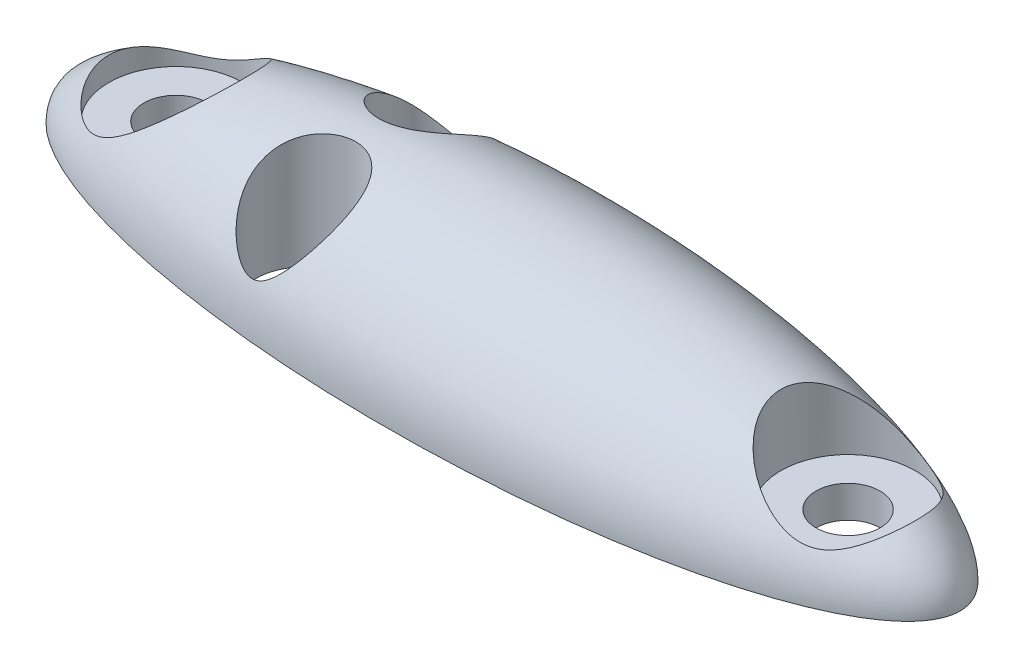
ISO-10303-21;
HEADER;
FILE_DESCRIPTION(('STEP AP214'),'2;1');
FILE_NAME('part.step','',(''),(''),'','','');
FILE_SCHEMA(('AUTOMOTIVE_DESIGN { 1 0 10303 214 1 1 1 1 }'));
ENDSEC;
DATA;
#1=APPLICATION_CONTEXT('core data for automotive mechanical design processes');
#2=APPLICATION_PROTOCOL_DEFINITION('international standard','automotive_design',2000,#1);
#3=PRODUCT_CONTEXT('',#1,'mechanical');
#4=PRODUCT('Part','Part','',(#3));
#5=PRODUCT_RELATED_PRODUCT_CATEGORY('part','',(#4));
#6=PRODUCT_DEFINITION_FORMATION('','',#4);
#7=PRODUCT_DEFINITION_CONTEXT('part definition',#1,'design');
#8=PRODUCT_DEFINITION('design','',#6,#7);
#9=PRODUCT_DEFINITION_SHAPE('','',#8);
#10=(LENGTH_UNIT() NAMED_UNIT(*) SI_UNIT(.MILLI.,.METRE.));
#11=(NAMED_UNIT(*) PLANE_ANGLE_UNIT() SI_UNIT($,.RADIAN.));
#12=(NAMED_UNIT(*) SI_UNIT($,.STERADIAN.) SOLID_ANGLE_UNIT());
#13=UNCERTAINTY_MEASURE_WITH_UNIT(LENGTH_MEASURE(1.E-05),#10,'distance_accuracy_value','');
#14=(GEOMETRIC_REPRESENTATION_CONTEXT(3) GLOBAL_UNCERTAINTY_ASSIGNED_CONTEXT((#13)) GLOBAL_UNIT_ASSIGNED_CONTEXT((#10,
#11,#12)) REPRESENTATION_CONTEXT('',''));
#15=CARTESIAN_POINT('',(0.,0.,0.));
#16=DIRECTION('',(0.,0.,1.));
#17=DIRECTION('',(1.,0.,0.));
#18=AXIS2_PLACEMENT_3D('',#15,#16,#17);
#19=CARTESIAN_POINT('',(0.,0.,0.));
#20=DIRECTION('',(0.,0.,1.));
#21=DIRECTION('',(1.,0.,0.));
#22=AXIS2_PLACEMENT_3D('',#19,#20,#21);
#23=ELLIPSE('',#22,14.,4.);
#24=TRIMMED_CURVE('',#23,(PARAMETER_VALUE(0.)),(PARAMETER_VALUE(3.14159265358979)),.T.,.PARAMETER.);
#25=CARTESIAN_POINT('',(-14.,0.,0.));
#26=DIRECTION('',(-1.,0.,0.));
#27=AXIS1_PLACEMENT('',#25,#26);
#28=SURFACE_OF_REVOLUTION('',#24,#27);
#29=CARTESIAN_POINT('',(-4.5,3.75458902884326,0.5));
#30=CARTESIAN_POINT('',(-4.41807485011896,3.76260614836175,0.50000363597045));
#31=CARTESIAN_POINT('',(-4.33595651778989,3.76951400484667,0.506736475512962));
#32=CARTESIAN_POINT('',(-4.17365789382002,3.78074165562019,0.533614555267595));
#33=CARTESIAN_POINT('',(-4.09348102663001,3.7850571571163,0.553781926500558));
#34=CARTESIAN_POINT('',(-3.9373667586053,3.7904003909163,0.60707313511103));
#35=CARTESIAN_POINT('',(-3.86143160721271,3.79142639471564,0.6402037739318));
#36=CARTESIAN_POINT('',(-3.71611708024833,3.78925528773884,0.718464693128925));
#37=CARTESIAN_POINT('',(-3.64673435057063,3.78606035030485,0.763588788578808));
#38=CARTESIAN_POINT('',(-3.5180087255229,3.77455230069718,0.863262391392315));
#39=CARTESIAN_POINT('',(-3.45847906139137,3.7663529388733,0.917583558350491));
#40=CARTESIAN_POINT('',(-3.34936442893969,3.74406836959943,1.03438083677035));
#41=CARTESIAN_POINT('',(-3.29977701911518,3.72998460979837,1.09685493989143));
#42=CARTESIAN_POINT('',(-3.213093005149,3.69588919890446,1.22559027741434));
#43=CARTESIAN_POINT('',(-3.17566229520513,3.67607092316599,1.29167847719049));
#44=CARTESIAN_POINT('',(-3.11177630355559,3.63023962510067,1.42691189099378));
#45=CARTESIAN_POINT('',(-3.08532102870517,3.60422659890459,1.49605710693031));
#46=CARTESIAN_POINT('',(-3.04276841530985,3.54562137017598,1.63668714066986));
#47=CARTESIAN_POINT('',(-3.02691778236253,3.51289418396723,1.70818957739984));
#48=CARTESIAN_POINT('',(-3.00580000899827,3.44186641187751,1.84995489692191));
#49=CARTESIAN_POINT('',(-3.00053894850754,3.40356263776331,1.92021704467924));
#50=CARTESIAN_POINT('',(-2.99935689992467,3.30719042563368,2.08327677369147));
#51=CARTESIAN_POINT('',(-3.00757555192905,3.24702949593765,2.17487422035254));
#52=CARTESIAN_POINT('',(-3.03877345363219,3.11985797810039,2.35043130917025));
#53=CARTESIAN_POINT('',(-3.06177607581734,3.05283668547919,2.43437861659217));
#54=CARTESIAN_POINT('',(-3.12908249893021,2.89161370596845,2.61892876740179));
#55=CARTESIAN_POINT('',(-3.17784032613489,2.7955609691125,2.71630372345697));
#56=CARTESIAN_POINT('',(-3.26317771342101,2.64779471493416,2.85034619804501));
#57=CARTESIAN_POINT('',(-3.29372364007854,2.59783058144781,2.89309038450693));
#58=CARTESIAN_POINT('',(-3.35854969867923,2.49707049018814,2.97457648241475));
#59=CARTESIAN_POINT('',(-3.39282851727974,2.44627483028071,3.01331979220137));
#60=CARTESIAN_POINT('',(-3.46575099768298,2.34303063644698,3.08770852455896));
#61=CARTESIAN_POINT('',(-3.50448096498131,2.29057207938731,3.12325489979644));
#62=CARTESIAN_POINT('',(-3.58549818344573,2.18575275922804,3.19014527083095));
#63=CARTESIAN_POINT('',(-3.62778423360408,2.13339196916781,3.22149067623285));
#64=CARTESIAN_POINT('',(-3.71588894260722,2.02959732931687,3.27982527293116));
#65=CARTESIAN_POINT('',(-3.76169430286799,1.97816081638799,3.30682977605818));
#66=CARTESIAN_POINT('',(-3.85734448052726,1.87699550229663,3.35642877495267));
#67=CARTESIAN_POINT('',(-3.90718520523312,1.82726504197265,3.37902766155747));
#68=CARTESIAN_POINT('',(-3.99618142916944,1.74542119024877,3.41340443431612));
#69=CARTESIAN_POINT('',(-4.03409516822564,1.71247411394185,3.42640012077026));
#70=CARTESIAN_POINT('',(-4.11287772249554,1.64908656059218,3.44976829535502));
#71=CARTESIAN_POINT('',(-4.15375111048626,1.61865012475627,3.46013660788907));
#72=CARTESIAN_POINT('',(-4.23946601041184,1.56152647205924,3.47785844625689));
#73=CARTESIAN_POINT('',(-4.28434955223465,1.5348890767369,3.48517397529937));
#74=CARTESIAN_POINT('',(-4.37800232272343,1.48853333917191,3.49576445431835));
#75=CARTESIAN_POINT('',(-4.42675475479499,1.46878690213824,3.49905595133379));
#76=CARTESIAN_POINT('',(-4.51010798901148,1.44477665734306,3.50032952233725));
#77=CARTESIAN_POINT('',(-4.54380978678468,1.43752373568976,3.4997482206439));
#78=CARTESIAN_POINT('',(-4.61180515951629,1.42842206532705,3.49621306070246));
#79=CARTESIAN_POINT('',(-4.6460979410206,1.42656656418169,3.49326217282802));
#80=CARTESIAN_POINT('',(-4.71423600859163,1.42847736034345,3.48501911761435));
#81=CARTESIAN_POINT('',(-4.74808124478457,1.4322442789662,3.47972669156468));
#82=CARTESIAN_POINT('',(-4.81442741130379,1.44481334973346,3.46706546679543));
#83=CARTESIAN_POINT('',(-4.84692627457216,1.45362295742576,3.45969360185707));
#84=CARTESIAN_POINT('',(-4.92601632692372,1.48071701343193,3.43907038116576));
#85=CARTESIAN_POINT('',(-4.97143606136329,1.50153958780102,3.42472989713746));
#86=CARTESIAN_POINT('',(-5.0580321712192,1.54898094407094,3.39310530977962));
#87=CARTESIAN_POINT('',(-5.09919344175167,1.57561938160205,3.37581126867891));
#88=CARTESIAN_POINT('',(-5.17693664663546,1.6318404067838,3.33923809105167));
#89=CARTESIAN_POINT('',(-5.21359709886264,1.66134869878057,3.32000874931687));
#90=CARTESIAN_POINT('',(-5.283894874729,1.72252486701728,3.27951385884961));
#91=CARTESIAN_POINT('',(-5.31752933297703,1.75419474124298,3.2582464187292));
#92=CARTESIAN_POINT('',(-5.38220820647823,1.81893673124208,3.21377548625682));
#93=CARTESIAN_POINT('',(-5.41324723362669,1.85201155918602,3.19056815698193));
#94=CARTESIAN_POINT('',(-5.47292660653057,1.91898204000486,3.14231594775773));
#95=CARTESIAN_POINT('',(-5.50156629496794,1.95287791455467,3.11727056776225));
#96=CARTESIAN_POINT('',(-5.57046359348816,2.03829791805734,3.05230475598018));
#97=CARTESIAN_POINT('',(-5.60930840754901,2.09010302534626,3.01124519233934));
#98=CARTESIAN_POINT('',(-5.68211136788364,2.19382860978281,2.92509037022632));
#99=CARTESIAN_POINT('',(-5.71606718976329,2.24574912996813,2.87999320855825));
#100=CARTESIAN_POINT('',(-5.77889659163847,2.34895876461261,2.785886661709));
#101=CARTESIAN_POINT('',(-5.80777799666982,2.40024873576438,2.73688347254694));
#102=CARTESIAN_POINT('',(-5.86016471116642,2.50171595645088,2.63500635871076));
#103=CARTESIAN_POINT('',(-5.88366963314842,2.55189312555075,2.58213215541485));
#104=CARTESIAN_POINT('',(-5.93607092534558,2.67773558346082,2.44260817306771));
#105=CARTESIAN_POINT('',(-5.96085674758974,2.75229062797892,2.35333535799789));
#106=CARTESIAN_POINT('',(-5.99361422483396,2.89549086239156,2.16733857694575));
#107=CARTESIAN_POINT('',(-6.00161079308781,2.96414466362686,2.07062587227006));
#108=CARTESIAN_POINT('',(-5.99816579403096,3.08284017595719,1.88913433498387));
#109=CARTESIAN_POINT('',(-5.98976671751321,3.13407034561422,1.80508339959451));
#110=CARTESIAN_POINT('',(-5.95775375020235,3.23026821889339,1.63623681616932));
#111=CARTESIAN_POINT('',(-5.93414526897219,3.2752381421984,1.55144144348194));
#112=CARTESIAN_POINT('',(-5.87062952561376,3.35856353214649,1.38402178772756));
#113=CARTESIAN_POINT('',(-5.83063212631771,3.39688072317921,1.30141224499498));
#114=CARTESIAN_POINT('',(-5.73449102844917,3.46655629824009,1.14290680709666));
#115=CARTESIAN_POINT('',(-5.67835395901769,3.49791752998049,1.06700817222195));
#116=CARTESIAN_POINT('',(-5.5577467986052,3.55147094610624,0.933006552624291));
#117=CARTESIAN_POINT('',(-5.49467347247373,3.57426673227075,0.873882710413801));
#118=CARTESIAN_POINT('',(-5.35836547791393,3.61549576819368,0.76682785288424));
#119=CARTESIAN_POINT('',(-5.2851289396516,3.63392821348957,0.718898901571785));
#120=CARTESIAN_POINT('',(-5.13378522134852,3.66659643737011,0.637865769043047));
#121=CARTESIAN_POINT('',(-5.05597196573819,3.6809658963429,0.60426416001008));
#122=CARTESIAN_POINT('',(-4.89548670524469,3.70700088917903,0.550612562313112));
#123=CARTESIAN_POINT('',(-4.81282402513206,3.71867141204822,0.530537436174912));
#124=CARTESIAN_POINT('',(-4.69118147359397,3.73386993082285,0.511738970657606));
#125=CARTESIAN_POINT('',(-4.65312127098125,3.73835196475833,0.507343972954385));
#126=CARTESIAN_POINT('',(-4.57672151710806,3.74683350761144,0.501473603195563));
#127=CARTESIAN_POINT('',(-4.53838195960883,3.75083300571747,0.499998296546651));
#128=CARTESIAN_POINT('',(-4.5,3.75458902884326,0.5));
#129=B_SPLINE_CURVE_WITH_KNOTS('',3,(#29,#30,#31,#32,#33,#34,#35,#36,#37,#38,#39,#40,#41,#42,
#43,#44,#45,#46,#47,#48,#49,#50,#51,#52,#53,#54,#55,#56,#57,#58,#59,#60,#61,#62,#63,#64,#65,#66,
#67,#68,#69,#70,#71,#72,#73,#74,#75,#76,#77,#78,#79,#80,#81,#82,#83,#84,#85,#86,#87,#88,#89,#90,
#91,#92,#93,#94,#95,#96,#97,#98,#99,#100,#101,#102,#103,#104,#105,#106,#107,#108,#109,#110,#111,
#112,#113,#114,#115,#116,#117,#118,#119,#120,#121,#122,#123,#124,#125,#126,#127,#128),
.UNSPECIFIED.,.T.,.F.,(4,2,2,2,2,2,2,2,2,2,2,2,2,2,2,2,2,2,2,2,2,2,2,2,2,2,2,2,2,2,2,2,2,2,2,2,
2,2,2,2,2,2,2,2,2,2,2,2,2,4),(0.,0.2468095129961,0.494026609869767,0.741373588548714,
0.988593259091779,1.23039270680192,1.47213270326522,1.70651839460132,1.94090423233467,
2.18056900875945,2.42037134777184,2.74823974821377,3.076627766358,3.50975769101555,
3.72711424003244,3.94439456210752,4.16699361655546,4.38951779150354,4.61123895622703,
4.83273800100568,4.98823147581826,5.14397054282238,5.30159404526799,5.45856718726719,
5.56155778588164,5.66441948270937,5.76729254729576,5.87031810262975,6.02537187457544,
6.18095801891379,6.33324927837106,6.48568326098794,6.63842622128767,6.79121089083234,
7.02093956240009,7.25077709671311,7.4802570371158,7.70975351093555,8.06508657624099,
8.41989199585019,8.71503547230905,9.01007403234007,9.30675752858199,9.60331933994352,
9.87019326243495,10.1371163498101,10.3938175842986,10.6500404423534,10.7656681899459,
10.8812985277926),.UNSPECIFIED.);
#130=CARTESIAN_POINT('',(-4.5,3.75458902884326,0.5));
#131=VERTEX_POINT('',#130);
#132=EDGE_CURVE('E70',#131,#131,#129,.T.);
#133=ORIENTED_EDGE('',*,*,#132,.T.);
#134=EDGE_LOOP('',(#133));
#135=FACE_BOUND('',#134,.T.);
#136=CARTESIAN_POINT('',(-4.5,1.44808106662238,-3.5));
#137=CARTESIAN_POINT('',(-4.47351777894604,1.45479901148154,-3.49999999579753));
#138=CARTESIAN_POINT('',(-4.44741414500903,1.46301554309756,-3.49929680840071));
#139=CARTESIAN_POINT('',(-4.39617244428583,1.48192884470348,-3.49662289169443));
#140=CARTESIAN_POINT('',(-4.3710357429364,1.49262898206634,-3.49465043496451));
#141=CARTESIAN_POINT('',(-4.32166360002188,1.51606962465879,-3.48956911698672));
#142=CARTESIAN_POINT('',(-4.29743504586217,1.52882288936807,-3.48645298213913));
#143=CARTESIAN_POINT('',(-4.25003809425809,1.55587614432375,-3.47922054028721));
#144=CARTESIAN_POINT('',(-4.22686932434376,1.57017558511681,-3.47510458793685));
#145=CARTESIAN_POINT('',(-4.16578598646231,1.610300317882,-3.4628183907973));
#146=CARTESIAN_POINT('',(-4.12877654730827,1.63724707522886,-3.45381493618217));
#147=CARTESIAN_POINT('',(-4.05713661679361,1.69339040031091,-3.43361690251878));
#148=CARTESIAN_POINT('',(-4.02250824612903,1.72258892571575,-3.42242040353326));
#149=CARTESIAN_POINT('',(-3.95528492487339,1.78248764562071,-3.39805707349413));
#150=CARTESIAN_POINT('',(-3.92269095281176,1.81318855027923,-3.38488930446718));
#151=CARTESIAN_POINT('',(-3.85929131631929,1.87558689572711,-3.3567220480217));
#152=CARTESIAN_POINT('',(-3.82848623884171,1.90728465839485,-3.34172196435762));
#153=CARTESIAN_POINT('',(-3.74585670724624,1.9954652153677,-3.29800576008562));
#154=CARTESIAN_POINT('',(-3.69569479290113,2.05261707485683,-3.26747482467387));
#155=CARTESIAN_POINT('',(-3.59978206688919,2.16766584475576,-3.20124971624867));
#156=CARTESIAN_POINT('',(-3.55403420549039,2.22556322455877,-3.16555212924492));
#157=CARTESIAN_POINT('',(-3.46690745904077,2.34124233578688,-3.08907158812857));
#158=CARTESIAN_POINT('',(-3.42552638843222,2.39902411072842,-3.04829120043922));
#159=CARTESIAN_POINT('',(-3.34731948497549,2.51384022032605,-2.96163031492496));
#160=CARTESIAN_POINT('',(-3.31049417435119,2.57087446862492,-2.91574923355315));
#161=CARTESIAN_POINT('',(-3.22181930938672,2.71644877228871,-2.79062888117602));
#162=CARTESIAN_POINT('',(-3.1736948325224,2.80401188783786,-2.70751297831471));
#163=CARTESIAN_POINT('',(-3.09287381933582,2.97316871817886,-2.52875284124325));
#164=CARTESIAN_POINT('',(-3.06014768209784,3.05477362932028,-2.43313309989322));
#165=CARTESIAN_POINT('',(-3.01956353379289,3.1911772858553,-2.2542531923851));
#166=CARTESIAN_POINT('',(-3.00768867298374,3.24779249831352,-2.17330182098318));
#167=CARTESIAN_POINT('',(-2.99768856524556,3.35428303379262,-2.00623803291594));
#168=CARTESIAN_POINT('',(-2.99954819005208,3.40416571089201,-1.92013139837711));
#169=CARTESIAN_POINT('',(-3.01769396843986,3.48878583581949,-1.75842025437156));
#170=CARTESIAN_POINT('',(-3.03177752494394,3.524672666676,-1.68317453120065));
#171=CARTESIAN_POINT('',(-3.07240529687337,3.58967416343796,-1.53308898304196));
#172=CARTESIAN_POINT('',(-3.09894432036744,3.61879164352136,-1.45824900206098));
#173=CARTESIAN_POINT('',(-3.16492237540424,3.66994475342583,-1.31147679295717));
#174=CARTESIAN_POINT('',(-3.20441207450062,3.69195188268629,-1.23955725306248));
#175=CARTESIAN_POINT('',(-3.29570149695131,3.72884327824599,-1.10195914888997));
#176=CARTESIAN_POINT('',(-3.34750030354813,3.74372807475353,-1.03628012034117));
#177=CARTESIAN_POINT('',(-3.45791612883266,3.76619979481601,-0.918276811196052));
#178=CARTESIAN_POINT('',(-3.51578663329115,3.77423030953961,-0.865335061718725));
#179=CARTESIAN_POINT('',(-3.63936878858474,3.7855174476841,-0.768962403602918));
#180=CARTESIAN_POINT('',(-3.70508023323244,3.78877419660726,-0.725531244956614));
#181=CARTESIAN_POINT('',(-3.84294214266296,3.79140669299484,-0.64925234254259));
#182=CARTESIAN_POINT('',(-3.91512793265545,3.7907596902753,-0.61646781376186));
#183=CARTESIAN_POINT('',(-4.06367326518747,3.78636044809561,-0.562689580357291));
#184=CARTESIAN_POINT('',(-4.14003340764045,3.78260776120324,-0.541697575399909));
#185=CARTESIAN_POINT('',(-4.29763177751486,3.77246047060735,-0.511475841745329));
#186=CARTESIAN_POINT('',(-4.37894736972802,3.76597893953405,-0.5026782719319));
#187=CARTESIAN_POINT('',(-4.54172158239601,3.750783006393,-0.498370813938799));
#188=CARTESIAN_POINT('',(-4.62318022012194,3.74206831321552,-0.502862658941496));
#189=CARTESIAN_POINT('',(-4.78600570771991,3.72224524761296,-0.52517323308039));
#190=CARTESIAN_POINT('',(-4.8673222026821,3.71108384307242,-0.54331323062073));
#191=CARTESIAN_POINT('',(-5.025496630446,3.68624274911033,-0.592620685774165));
#192=CARTESIAN_POINT('',(-5.1023543571663,3.67256294341166,-0.623788744990443));
#193=CARTESIAN_POINT('',(-5.25029759097347,3.64197557230809,-0.698463397107779));
#194=CARTESIAN_POINT('',(-5.32130477548687,3.62503201242385,-0.742110492810504));
#195=CARTESIAN_POINT('',(-5.45449621924842,3.58732810220361,-0.839929452283154));
#196=CARTESIAN_POINT('',(-5.51668097366725,3.5665679662283,-0.894100724964925));
#197=CARTESIAN_POINT('',(-5.63101647752377,3.52038548109548,-1.01128809332135));
#198=CARTESIAN_POINT('',(-5.68309045404082,3.49493012010285,-1.07436602458478));
#199=CARTESIAN_POINT('',(-5.77552019130414,3.43897593980794,-1.20655465941216));
#200=CARTESIAN_POINT('',(-5.81587572589431,3.4084770231871,-1.27566547937231));
#201=CARTESIAN_POINT('',(-5.88530869815153,3.3414284212389,-1.41911163123653));
#202=CARTESIAN_POINT('',(-5.9140727507137,3.30474442413917,-1.49353519175492));
#203=CARTESIAN_POINT('',(-5.95908455959321,3.22610878519917,-1.64335005590368));
#204=CARTESIAN_POINT('',(-5.97532817184653,3.18415540461645,-1.71874167155791));
#205=CARTESIAN_POINT('',(-5.99700531755927,3.09168292056793,-1.87471720617862));
#206=CARTESIAN_POINT('',(-6.00139179318604,3.04073772643215,-1.95519163396006));
#207=CARTESIAN_POINT('',(-5.99784184451688,2.93415617580062,-2.11261394667822));
#208=CARTESIAN_POINT('',(-5.98990021228752,2.87851784610935,-2.18956032707393));
#209=CARTESIAN_POINT('',(-5.95746065949153,2.73854970185945,-2.37091949351887));
#210=CARTESIAN_POINT('',(-5.92728666553439,2.65222034592066,-2.47281411893998));
#211=CARTESIAN_POINT('',(-5.86836761063565,2.51916419538994,-2.61666416135629));
#212=CARTESIAN_POINT('',(-5.84639164864335,2.4741211971995,-2.66320275003486));
#213=CARTESIAN_POINT('',(-5.79820016104462,2.38321521850195,-2.75317790605821));
#214=CARTESIAN_POINT('',(-5.77198616554305,2.33735253922914,-2.79661558483033));
#215=CARTESIAN_POINT('',(-5.7151017721006,2.24445851696929,-2.88100008651879));
#216=CARTESIAN_POINT('',(-5.68436575376479,2.19742030512021,-2.9218948262683));
#217=CARTESIAN_POINT('',(-5.61887095612279,2.10340960616676,-3.00036963548024));
#218=CARTESIAN_POINT('',(-5.58411354405667,2.05643710218745,-3.03795082390964));
#219=CARTESIAN_POINT('',(-5.51061706858621,1.96336851426534,-3.10963006896845));
#220=CARTESIAN_POINT('',(-5.4718947488596,1.91726964572421,-3.14374165154959));
#221=CARTESIAN_POINT('',(-5.38996974695501,1.82664057034387,-3.20858923513695));
#222=CARTESIAN_POINT('',(-5.34676647461589,1.78211057116894,-3.23932479040513));
#223=CARTESIAN_POINT('',(-5.26739453873903,1.70766707901952,-3.28944885869193));
#224=CARTESIAN_POINT('',(-5.23243677209259,1.67703075223918,-3.30967300697047));
#225=CARTESIAN_POINT('',(-5.15927944786623,1.61846806144936,-3.34798121539742));
#226=CARTESIAN_POINT('',(-5.12108479579622,1.59053772946461,-3.36606841790538));
#227=CARTESIAN_POINT('',(-5.04026844660505,1.53854981600825,-3.40002253612708));
#228=CARTESIAN_POINT('',(-4.99759113680443,1.51455348945027,-3.41585390750273));
#229=CARTESIAN_POINT('',(-4.90794324955167,1.47369983058142,-3.44421736491533));
#230=CARTESIAN_POINT('',(-4.86099197441409,1.45681216670508,-3.45676338055488));
#231=CARTESIAN_POINT('',(-4.77964677414861,1.4373796949993,-3.47408095437563));
#232=CARTESIAN_POINT('',(-4.74621052815184,1.43194279646288,-3.48005213073433));
#233=CARTESIAN_POINT('',(-4.67857727795214,1.42657126637477,-3.48972148617927));
#234=CARTESIAN_POINT('',(-4.64438129731262,1.42662963318926,-3.49342255160693));
#235=CARTESIAN_POINT('',(-4.59177061360102,1.43097856291041,-3.4973073719191));
#236=CARTESIAN_POINT('',(-4.57323075643239,1.43333814935829,-3.498325045377));
#237=CARTESIAN_POINT('',(-4.53640169916313,1.43959270156669,-3.49967107309021));
#238=CARTESIAN_POINT('',(-4.51811230248049,1.44348638217018,-3.50000000287425));
#239=CARTESIAN_POINT('',(-4.5,1.44808106662238,-3.5));
#240=B_SPLINE_CURVE_WITH_KNOTS('',3,(#136,#137,#138,#139,#140,#141,#142,#143,#144,#145,#146,
#147,#148,#149,#150,#151,#152,#153,#154,#155,#156,#157,#158,#159,#160,#161,#162,#163,#164,#165,
#166,#167,#168,#169,#170,#171,#172,#173,#174,#175,#176,#177,#178,#179,#180,#181,#182,#183,#184,
#185,#186,#187,#188,#189,#190,#191,#192,#193,#194,#195,#196,#197,#198,#199,#200,#201,#202,#203,
#204,#205,#206,#207,#208,#209,#210,#211,#212,#213,#214,#215,#216,#217,#218,#219,#220,#221,#222,
#223,#224,#225,#226,#227,#228,#229,#230,#231,#232,#233,#234,#235,#236,#237,#238,#239),
.UNSPECIFIED.,.T.,.F.,(4,2,2,2,2,2,2,2,2,2,2,2,2,2,2,2,2,2,2,2,2,2,2,2,2,2,2,2,2,2,2,2,2,2,2,2,
2,2,2,2,2,2,2,2,2,2,2,2,2,2,2,4),(0.,0.0819288070538273,0.16396935215537,0.246540967763296,
0.329083336336555,0.468814199146219,0.608667942895542,0.748588444871685,0.888554599671452,
1.1340440649204,1.37969649019858,1.62522537860276,1.87078238580092,2.25921449672344,
2.64689682538189,2.94427957215139,3.24133480659455,3.4938956670294,3.74635134348505,
3.99980673837407,4.2532432623295,4.48866249527247,4.72407553893462,4.96086183669498,
5.19768225391469,5.44269761339067,5.68774492875227,5.93874834281156,6.18976334885908,
6.44372406507931,6.69767052177156,6.95347568080165,7.20928577632818,7.47161044363925,
7.73402189894934,8.01894774467864,8.30399398834063,8.71235247401035,8.91738500997277,
9.12234368537245,9.33064010511728,9.53886591279375,9.74624606750496,9.95365356985994,
10.1055642107809,10.2572486123719,10.41110739587,10.5643028647151,10.6670386463616,
10.7696435319492,10.8257249633348,10.8817595131636),.UNSPECIFIED.);
#241=CARTESIAN_POINT('',(-4.5,1.44808106662238,-3.5));
#242=VERTEX_POINT('',#241);
#243=EDGE_CURVE('E74',#242,#242,#240,.T.);
#244=ORIENTED_EDGE('',*,*,#243,.T.);
#245=EDGE_LOOP('',(#244));
#246=FACE_BOUND('',#245,.T.);
#247=CARTESIAN_POINT('',(-10.5,1.60934769394311,-2.1));
#248=CARTESIAN_POINT('',(-10.4209734122459,1.65143420426542,-2.10000131762377));
#249=CARTESIAN_POINT('',(-10.3434440073707,1.69639745496097,-2.0955506533599));
#250=CARTESIAN_POINT('',(-10.1913598551556,1.78981821811153,-2.07860705529194));
#251=CARTESIAN_POINT('',(-10.1168101155128,1.83828125799034,-2.06610114131829));
#252=CARTESIAN_POINT('',(-9.9702390854039,1.93737193467093,-2.03347456598901));
#253=CARTESIAN_POINT('',(-9.89823486498157,1.98801044720783,-2.0133103862909));
#254=CARTESIAN_POINT('',(-9.75728236048426,2.08994580493803,-1.96568019855641));
#255=CARTESIAN_POINT('',(-9.68833214900592,2.14124220778922,-1.93821887466169));
#256=CARTESIAN_POINT('',(-9.50384966054523,2.28128860333896,-1.85319269734035));
#257=CARTESIAN_POINT('',(-9.39139419718499,2.36980964779735,-1.78834943335908));
#258=CARTESIAN_POINT('',(-9.17804799775228,2.54126946025989,-1.63690809906218));
#259=CARTESIAN_POINT('',(-9.07711759067938,2.62422694514435,-1.55038814449628));
#260=CARTESIAN_POINT('',(-8.91173851584674,2.76192528082536,-1.37775167826839));
#261=CARTESIAN_POINT('',(-8.84426104589568,2.81874482278595,-1.29620793524524));
#262=CARTESIAN_POINT('',(-8.7203960034258,2.92377252538621,-1.12007409785245));
#263=CARTESIAN_POINT('',(-8.6639988354946,2.97198813358289,-1.02549541345599));
#264=CARTESIAN_POINT('',(-8.5740398918738,3.04924074394735,-0.84213324180284));
#265=CARTESIAN_POINT('',(-8.53820531513645,3.08016019413125,-0.7552662403171));
#266=CARTESIAN_POINT('',(-8.477982597523,3.13224440516493,-0.574862054009301));
#267=CARTESIAN_POINT('',(-8.45358655875996,3.15341589643704,-0.481329523044182));
#268=CARTESIAN_POINT('',(-8.41773500422139,3.18456055682782,-0.289393883857317));
#269=CARTESIAN_POINT('',(-8.40635313301124,3.19446999435238,-0.190966314314159));
#270=CARTESIAN_POINT('',(-8.39767888741019,3.20202019189904,0.00697522794760886));
#271=CARTESIAN_POINT('',(-8.40038261359837,3.1996643474107,0.106488892382527));
#272=CARTESIAN_POINT('',(-8.41873570469273,3.18369703721893,0.293897740398332));
#273=CARTESIAN_POINT('',(-8.43315543324997,3.1711547263428,0.382011563798604));
#274=CARTESIAN_POINT('',(-8.47247589693887,3.13703140760446,0.55401471590958));
#275=CARTESIAN_POINT('',(-8.49737770678136,3.11544947292536,0.637903610457433));
#276=CARTESIAN_POINT('',(-8.55782508813899,3.06323349557525,0.803829344657878));
#277=CARTESIAN_POINT('',(-8.59383623869343,3.0322044842708,0.885569295890076));
#278=CARTESIAN_POINT('',(-8.67440631180034,2.96310978518446,1.04160126414614));
#279=CARTESIAN_POINT('',(-8.71897666801134,2.92503468751805,1.11588311396859));
#280=CARTESIAN_POINT('',(-8.80274422162959,2.85391825405269,1.23827323190543));
#281=CARTESIAN_POINT('',(-8.84037173915895,2.8221036628096,1.28819723736775));
#282=CARTESIAN_POINT('',(-8.91894785418084,2.75603284049121,1.38350456211226));
#283=CARTESIAN_POINT('',(-8.95989365712104,2.72177866683991,1.42889163175704));
#284=CARTESIAN_POINT('',(-9.087247194751,2.61594150151342,1.55846640545728));
#285=CARTESIAN_POINT('',(-9.17808335655521,2.54135892327486,1.63594262709184));
#286=CARTESIAN_POINT('',(-9.37047946915258,2.38651034596648,1.7744035676839));
#287=CARTESIAN_POINT('',(-9.47220260800227,2.30616637481496,1.83506739491974));
#288=CARTESIAN_POINT('',(-9.68362943352589,2.144247987393,1.93839845790641));
#289=CARTESIAN_POINT('',(-9.79333497425821,2.06267328877361,1.98106149690082));
#290=CARTESIAN_POINT('',(-9.95958958358823,1.94511399084755,2.03002216434123));
#291=CARTESIAN_POINT('',(-10.0132997641207,1.90800768331128,2.04358172053704));
#292=CARTESIAN_POINT('',(-10.1223508849207,1.83493174396179,2.06651562606789));
#293=CARTESIAN_POINT('',(-10.1776911560524,1.79896165796824,2.07589166785951));
#294=CARTESIAN_POINT('',(-10.2900085972404,1.72881992264886,2.09024040538197));
#295=CARTESIAN_POINT('',(-10.3469843607261,1.69464679552613,2.0952167743518));
#296=CARTESIAN_POINT('',(-10.4626038773335,1.62892616784999,2.10046473860563));
#297=CARTESIAN_POINT('',(-10.5212467400815,1.59737729979757,2.10073879973694));
#298=CARTESIAN_POINT('',(-10.6573795081354,1.52939078707956,2.09549537066697));
#299=CARTESIAN_POINT('',(-10.7354436786617,1.49415271019503,2.08829133336176));
#300=CARTESIAN_POINT('',(-10.853994199151,1.44811551509979,2.07033406210167));
#301=CARTESIAN_POINT('',(-10.8937270569378,1.43391347395169,2.06316343128542));
#302=CARTESIAN_POINT('',(-10.9735099095893,1.40814918471928,2.04632559362616));
#303=CARTESIAN_POINT('',(-11.0135597215001,1.39658551445941,2.03665973781586));
#304=CARTESIAN_POINT('',(-11.094165425735,1.37631410519305,2.01462958903609));
#305=CARTESIAN_POINT('',(-11.1347218960432,1.36764032251293,2.00223587277453));
#306=CARTESIAN_POINT('',(-11.2155088195142,1.35356054578818,1.97480788042425));
#307=CARTESIAN_POINT('',(-11.2557392974718,1.34815430086942,1.95977380717055));
#308=CARTESIAN_POINT('',(-11.3354743741771,1.34065222387266,1.92713229554071));
#309=CARTESIAN_POINT('',(-11.3749787001983,1.33855761143784,1.90952391167716));
#310=CARTESIAN_POINT('',(-11.4528545616125,1.33751879409295,1.87188132543829));
#311=CARTESIAN_POINT('',(-11.4912259428332,1.3385750159741,1.85184679478578));
#312=CARTESIAN_POINT('',(-11.5702846954148,1.34374710704501,1.80741439405524));
#313=CARTESIAN_POINT('',(-11.6108197315259,1.34815849589994,1.78278052071496));
#314=CARTESIAN_POINT('',(-11.6898629605472,1.35979142511742,1.73102925729613));
#315=CARTESIAN_POINT('',(-11.7283696418467,1.36701502853506,1.70391005516081));
#316=CARTESIAN_POINT('',(-11.8407591611483,1.39195810494593,1.61900846877252));
#317=CARTESIAN_POINT('',(-11.9113541157072,1.41293486024175,1.55777127741802));
#318=CARTESIAN_POINT('',(-12.0205232280511,1.45091517137529,1.44973473438894));
#319=CARTESIAN_POINT('',(-12.0617853202022,1.46682014260002,1.40517049037538));
#320=CARTESIAN_POINT('',(-12.1402296174059,1.49925324334537,1.31275157201679));
#321=CARTESIAN_POINT('',(-12.1774108147228,1.5157815254385,1.26489608965811));
#322=CARTESIAN_POINT('',(-12.2475218437144,1.54852476985896,1.16611939467008));
#323=CARTESIAN_POINT('',(-12.280454351601,1.56473992389472,1.11520014181994));
#324=CARTESIAN_POINT('',(-12.3419357662032,1.59610282638224,1.01042678547276));
#325=CARTESIAN_POINT('',(-12.3704826700093,1.61125008542674,0.95657135614381));
#326=CARTESIAN_POINT('',(-12.422981407253,1.63982405970158,0.846101743234768));
#327=CARTESIAN_POINT('',(-12.4469253515469,1.65324780811135,0.789483028146517));
#328=CARTESIAN_POINT('',(-12.4898720929744,1.67775946941476,0.673946465806939));
#329=CARTESIAN_POINT('',(-12.5088780049872,1.68884885396815,0.61503009501276));
#330=CARTESIAN_POINT('',(-12.5416782411809,1.70821415204776,0.495372580425835));
#331=CARTESIAN_POINT('',(-12.5554778436637,1.71649291420378,0.434633352527247));
#332=CARTESIAN_POINT('',(-12.5776552732665,1.72988690088153,0.311832077653073));
#333=CARTESIAN_POINT('',(-12.5860340945654,1.73500270548646,0.249770275397372));
#334=CARTESIAN_POINT('',(-12.5964623460617,1.74138415262275,0.133366998522504));
#335=CARTESIAN_POINT('',(-12.5992117213289,1.74307522746053,0.0791103312854765));
#336=CARTESIAN_POINT('',(-12.6004951649014,1.74386381373383,-0.0294910821492246));
#337=CARTESIAN_POINT('',(-12.5990278819685,1.74296049378938,-0.0838358510023145));
#338=CARTESIAN_POINT('',(-12.5918966478564,1.73858812267192,-0.19211991894679));
#339=CARTESIAN_POINT('',(-12.5862347232754,1.73512031050859,-0.24605940114025));
#340=CARTESIAN_POINT('',(-12.5708028519786,1.72574235922895,-0.353138898051337));
#341=CARTESIAN_POINT('',(-12.5610313135067,1.71983127378724,-0.406278594722712));
#342=CARTESIAN_POINT('',(-12.5272853501419,1.69963384488084,-0.556959295468164));
#343=CARTESIAN_POINT('',(-12.4983415829939,1.68252904179946,-0.653062124292442));
#344=CARTESIAN_POINT('',(-12.427682085743,1.6423395516025,-0.839029756730497));
#345=CARTESIAN_POINT('',(-12.3859607319181,1.61925223212809,-0.928891792215082));
#346=CARTESIAN_POINT('',(-12.2856158082219,1.56692767275004,-1.11062804395449));
#347=CARTESIAN_POINT('',(-12.2256428579024,1.53729400345931,-1.20164776709639));
#348=CARTESIAN_POINT('',(-12.1256965750334,1.49313266816627,-1.33043947233908));
#349=CARTESIAN_POINT('',(-12.0906877101672,1.47844989655063,-1.37210774222008));
#350=CARTESIAN_POINT('',(-12.0173929775362,1.44991209877204,-1.45275233193063));
#351=CARTESIAN_POINT('',(-11.9791073635288,1.43605700865278,-1.49172885979186));
#352=CARTESIAN_POINT('',(-11.875155402858,1.40212093381479,-1.58954840528397));
#353=CARTESIAN_POINT('',(-11.8069059963234,1.38332721104376,-1.64618927394501));
#354=CARTESIAN_POINT('',(-11.6987994325602,1.36146467530663,-1.72477916896278));
#355=CARTESIAN_POINT('',(-11.6618431070227,1.35523451270557,-1.74989482843937));
#356=CARTESIAN_POINT('',(-11.5861545851853,1.34542149519424,-1.7978518339282));
#357=CARTESIAN_POINT('',(-11.5474235378886,1.34183695245546,-1.82069462190347));
#358=CARTESIAN_POINT('',(-11.474443927403,1.33810486701482,-1.86062285206911));
#359=CARTESIAN_POINT('',(-11.4404076652084,1.33751810545354,-1.87805584649113));
#360=CARTESIAN_POINT('',(-11.3714830723181,1.33881436140664,-1.9110142183121));
#361=CARTESIAN_POINT('',(-11.3365951356071,1.34069625739824,-1.92654045845485));
#362=CARTESIAN_POINT('',(-11.2662130141211,1.34704218684759,-1.9555989047031));
#363=CARTESIAN_POINT('',(-11.2307186367657,1.3515070559172,-1.96913046373532));
#364=CARTESIAN_POINT('',(-11.1594289129819,1.36299733785046,-1.99413710104801));
#365=CARTESIAN_POINT('',(-11.1236335581081,1.37002282280025,-2.0056121214195));
#366=CARTESIAN_POINT('',(-11.016507099062,1.39469851254764,-2.03684163251687));
#367=CARTESIAN_POINT('',(-10.9450889677904,1.41598055073299,-2.05354190738941));
#368=CARTESIAN_POINT('',(-10.8037040274116,1.4663154035419,-2.07917016403377));
#369=CARTESIAN_POINT('',(-10.7337377150047,1.49537083188171,-2.08809552727376));
#370=CARTESIAN_POINT('',(-10.6370138946536,1.54006945064786,-2.09571141022123));
#371=CARTESIAN_POINT('',(-10.6093503715588,1.55338893107564,-2.09733153220967));
#372=CARTESIAN_POINT('',(-10.5543993698054,1.58080911553577,-2.09947511372935));
#373=CARTESIAN_POINT('',(-10.5271115783923,1.59490911376028,-2.09999954796403));
#374=CARTESIAN_POINT('',(-10.5,1.60934769394311,-2.1));
#375=B_SPLINE_CURVE_WITH_KNOTS('',3,(#247,#248,#249,#250,#251,#252,#253,#254,#255,#256,#257,
#258,#259,#260,#261,#262,#263,#264,#265,#266,#267,#268,#269,#270,#271,#272,#273,#274,#275,#276,
#277,#278,#279,#280,#281,#282,#283,#284,#285,#286,#287,#288,#289,#290,#291,#292,#293,#294,#295,
#296,#297,#298,#299,#300,#301,#302,#303,#304,#305,#306,#307,#308,#309,#310,#311,#312,#313,#314,
#315,#316,#317,#318,#319,#320,#321,#322,#323,#324,#325,#326,#327,#328,#329,#330,#331,#332,#333,
#334,#335,#336,#337,#338,#339,#340,#341,#342,#343,#344,#345,#346,#347,#348,#349,#350,#351,#352,
#353,#354,#355,#356,#357,#358,#359,#360,#361,#362,#363,#364,#365,#366,#367,#368,#369,#370,#371,
#372,#373,#374),.UNSPECIFIED.,.T.,.F.,(4,2,2,2,2,2,2,2,2,2,2,2,2,2,2,2,2,2,2,2,2,2,2,2,2,2,2,2,
2,2,2,2,2,2,2,2,2,2,2,2,2,2,2,2,2,2,2,2,2,2,2,2,2,2,2,2,2,2,2,2,2,2,2,4),(0.,0.268554998493359,
0.537543830814705,0.808084642577288,1.07845220808125,1.54786523546352,2.0156103886229,
2.37472670912209,2.73353065486925,3.02909682375592,3.32445861352174,3.62148365094237,
3.91842646507802,4.18770265154609,4.45700645319287,4.73963185375287,5.02263745404392,
5.2328017180642,5.44279079206636,5.86327311238737,6.29130104421253,6.7194287126539,
6.91932977174217,7.11914988661361,7.31880301587502,7.51835144565678,7.77523057694287,
7.90350310332526,8.03170632204323,8.16136677861864,8.29101727889417,8.42071551711898,
8.55043132420828,8.69312404722196,8.8359216482102,9.122054649787,9.31022286265116,
9.49843743770076,9.68653287311728,9.87471395814579,10.0632147514279,10.2515963493348,
10.4397864441961,10.6279420149392,10.7907806447794,10.9536714624677,11.1164836324029,
11.2793589217133,11.5834115416423,11.8875981751965,12.2250477336122,12.3940172641632,
12.5629737212301,12.8338695745852,12.9690826531743,13.1042093950115,13.218819194977,
13.3333769451966,13.4479717764786,13.5625698340686,13.7906534810167,14.018813915157,
14.1110288979053,14.2031618129308),.UNSPECIFIED.);
#376=CARTESIAN_POINT('',(-10.5,1.60934769394311,-2.1));
#377=VERTEX_POINT('',#376);
#378=EDGE_CURVE('E40',#377,#377,#375,.T.);
#379=ORIENTED_EDGE('',*,*,#378,.T.);
#380=EDGE_LOOP('',(#379));
#381=FACE_BOUND('',#380,.T.);
#382=CARTESIAN_POINT('',(10.5,1.6093476939431,-2.1));
#383=CARTESIAN_POINT('',(10.5759866402752,1.5688736493634,-2.1000018736757));
#384=CARTESIAN_POINT('',(10.653415601625,1.53102214228506,-2.09589297861588));
#385=CARTESIAN_POINT('',(10.8107419364172,1.46338225103615,-2.07838035892866));
#386=CARTESIAN_POINT('',(10.8906348108524,1.43358003988579,-2.06499271616559));
#387=CARTESIAN_POINT('',(11.0117221552647,1.39709129839308,-2.03712828813162));
#388=CARTESIAN_POINT('',(11.052567665969,1.38625360481856,-2.0264456503405));
#389=CARTESIAN_POINT('',(11.1341982775671,1.36774876939079,-2.00239867474741));
#390=CARTESIAN_POINT('',(11.1749833833607,1.36008135455017,-1.98903456798948));
#391=CARTESIAN_POINT('',(11.2560569779074,1.34810601436227,-1.95965173081142));
#392=CARTESIAN_POINT('',(11.2963457981532,1.34379571180588,-1.94363488858692));
#393=CARTESIAN_POINT('',(11.3760251536078,1.33849232844775,-1.90904929255956));
#394=CARTESIAN_POINT('',(11.4154156992142,1.33749920922932,-1.89048056831294));
#395=CARTESIAN_POINT('',(11.5219010364477,1.33903409781747,-1.83615962802587));
#396=CARTESIAN_POINT('',(11.5877108157277,1.34474652566412,-1.79793279281379));
#397=CARTESIAN_POINT('',(11.7141290732008,1.36337392199556,-1.71511904670054));
#398=CARTESIAN_POINT('',(11.7747277493983,1.3763021354193,-1.67052055263142));
#399=CARTESIAN_POINT('',(11.8779985015791,1.40350434245106,-1.58574854950991));
#400=CARTESIAN_POINT('',(11.9217637931008,1.41692651724254,-1.54661062548948));
#401=CARTESIAN_POINT('',(12.0056158551899,1.44546167259047,-1.46510788656148));
#402=CARTESIAN_POINT('',(12.0457008464276,1.46057546324489,-1.42274152871544));
#403=CARTESIAN_POINT('',(12.1221452604123,1.49151842208934,-1.33492978025759));
#404=CARTESIAN_POINT('',(12.1585002858857,1.50734840364117,-1.28948085805854));
#405=CARTESIAN_POINT('',(12.2273513081483,1.53888221464721,-1.19567688008549));
#406=CARTESIAN_POINT('',(12.2598458055108,1.55458599289057,-1.14732070604747));
#407=CARTESIAN_POINT('',(12.3213969534077,1.58544420433244,-1.04692210946372));
#408=CARTESIAN_POINT('',(12.3503756460969,1.60058230784928,-0.99482674773867));
#409=CARTESIAN_POINT('',(12.403938839247,1.6293309497375,-0.888022886605616));
#410=CARTESIAN_POINT('',(12.4285239406667,1.64294169692697,-0.833314745874779));
#411=CARTESIAN_POINT('',(12.4730299598839,1.66806182692212,-0.721637718885636));
#412=CARTESIAN_POINT('',(12.4929563117957,1.67957365448759,-0.664671558124872));
#413=CARTESIAN_POINT('',(12.527912291889,1.70003618091955,-0.548842213966648));
#414=CARTESIAN_POINT('',(12.5429451641877,1.70898857607261,-0.489980315907056));
#415=CARTESIAN_POINT('',(12.5671045044965,1.72349285154309,-0.374604380484292));
#416=CARTESIAN_POINT('',(12.5765456764921,1.72922471553439,-0.318178938354421));
#417=CARTESIAN_POINT('',(12.5907967880986,1.73790934390751,-0.204560751881002));
#418=CARTESIAN_POINT('',(12.5956091015162,1.74086353274042,-0.147368416096663));
#419=CARTESIAN_POINT('',(12.6005291032824,1.74388368120898,-0.0326986993564792));
#420=CARTESIAN_POINT('',(12.6006365675413,1.74394950327306,0.0247786950461746));
#421=CARTESIAN_POINT('',(12.5961509038847,1.74119633270024,0.139461735154409));
#422=CARTESIAN_POINT('',(12.5915581218902,1.73837755235949,0.196667400546981));
#423=CARTESIAN_POINT('',(12.5724171974813,1.72670171165596,0.353986120472685));
#424=CARTESIAN_POINT('',(12.552933481783,1.71487054953356,0.453329514364308));
#425=CARTESIAN_POINT('',(12.5003717844189,1.68381610054256,0.646996075433936));
#426=CARTESIAN_POINT('',(12.467297935136,1.6645950608451,0.741320758823718));
#427=CARTESIAN_POINT('',(12.3865422140008,1.61968554142349,0.928393997271802));
#428=CARTESIAN_POINT('',(12.3381467001961,1.59369543439804,1.02075925213889));
#429=CARTESIAN_POINT('',(12.2285396996432,1.5390578500067,1.19706587098488));
#430=CARTESIAN_POINT('',(12.1672913019286,1.51040285452097,1.28098192047699));
#431=CARTESIAN_POINT('',(12.0611057141662,1.46656219632953,1.40590439964681));
#432=CARTESIAN_POINT('',(12.0201317634959,1.45077709112242,1.45012243915698));
#433=CARTESIAN_POINT('',(11.9341849412114,1.42087967837213,1.53517701116027));
#434=CARTESIAN_POINT('',(11.8892106132746,1.4067679844262,1.57601230164133));
#435=CARTESIAN_POINT('',(11.7955947241173,1.38154870263661,1.65382056904832));
#436=CARTESIAN_POINT('',(11.7469707179735,1.37042778194533,1.69081022107157));
#437=CARTESIAN_POINT('',(11.6461396211972,1.35253365928911,1.76071450363509));
#438=CARTESIAN_POINT('',(11.5939363469379,1.34575590386238,1.79363337273805));
#439=CARTESIAN_POINT('',(11.5067485087146,1.3393742587006,1.84335184875667));
#440=CARTESIAN_POINT('',(11.4726823818577,1.33803004414624,1.86155350433252));
#441=CARTESIAN_POINT('',(11.4035946566109,1.33780343750362,1.89605005057184));
#442=CARTESIAN_POINT('',(11.3685733630419,1.33892026889769,1.91234554096663));
#443=CARTESIAN_POINT('',(11.2978621384596,1.34376861700861,1.94290966730197));
#444=CARTESIAN_POINT('',(11.2621727213441,1.34749819850664,1.95717979399245));
#445=CARTESIAN_POINT('',(11.1904014680096,1.35758494621244,1.98363588613722));
#446=CARTESIAN_POINT('',(11.1543196103302,1.36394225682702,1.99582173699813));
#447=CARTESIAN_POINT('',(11.0461800116983,1.38677687746828,2.02912441073525));
#448=CARTESIAN_POINT('',(10.9739198852838,1.40703870679547,2.0471181637502));
#449=CARTESIAN_POINT('',(10.830640614019,1.45582385588529,2.07509999083191));
#450=CARTESIAN_POINT('',(10.7596239876685,1.48436225628952,2.08507332470132));
#451=CARTESIAN_POINT('',(10.6329502405289,1.54143342575778,2.09656064526587));
#452=CARTESIAN_POINT('',(10.5769293698934,1.56894557643416,2.09931817417972));
#453=CARTESIAN_POINT('',(10.4663471794911,1.62688658930994,2.10045886067729));
#454=CARTESIAN_POINT('',(10.4117867362103,1.6573171549461,2.09883944833025));
#455=CARTESIAN_POINT('',(10.3040384566807,1.72032650071688,2.09153579698532));
#456=CARTESIAN_POINT('',(10.2508542937783,1.75291034053562,2.08584165105011));
#457=CARTESIAN_POINT('',(10.1459497739363,1.81951796723231,2.07061773979));
#458=CARTESIAN_POINT('',(10.0942298329667,1.85354215658238,2.06108689597387));
#459=CARTESIAN_POINT('',(9.9732295164585,1.9353567452357,2.03412347924655));
#460=CARTESIAN_POINT('',(9.90458226655401,1.98355513615669,2.01507005588601));
#461=CARTESIAN_POINT('',(9.76998080863406,2.08064556734628,1.97030532913757));
#462=CARTESIAN_POINT('',(9.70402763294732,2.12953786401683,1.94459150078104));
#463=CARTESIAN_POINT('',(9.57499413636718,2.22712209932589,1.88662683490214));
#464=CARTESIAN_POINT('',(9.51191137562377,2.2758141748669,1.85438168110126));
#465=CARTESIAN_POINT('',(9.38880617527364,2.3722792626148,1.78333919865697));
#466=CARTESIAN_POINT('',(9.32878417254444,2.42005214301771,1.74454093804453));
#467=CARTESIAN_POINT('',(9.17628085300072,2.5428371785818,1.63440318263932));
#468=CARTESIAN_POINT('',(9.08651691139278,2.61654932908168,1.55771724391251));
#469=CARTESIAN_POINT('',(8.91849290534026,2.75618384748261,1.38677489373899));
#470=CARTESIAN_POINT('',(8.84021275490277,2.82211977596807,1.29254983081457));
#471=CARTESIAN_POINT('',(8.71465512865318,2.92869515034755,1.10991739162178));
#472=CARTESIAN_POINT('',(8.66436408829598,2.97168922657594,1.02496339740067));
#473=CARTESIAN_POINT('',(8.57503794038161,3.04837048705493,0.845304748509787));
#474=CARTESIAN_POINT('',(8.53599763960432,3.08206196498284,0.750604620034288));
#475=CARTESIAN_POINT('',(8.48755515029665,3.12397009285438,0.602344588694103));
#476=CARTESIAN_POINT('',(8.47304664642513,3.13654266451825,0.551616583709707));
#477=CARTESIAN_POINT('',(8.44778206601762,3.15845778779057,0.448564206279762));
#478=CARTESIAN_POINT('',(8.43702398901099,3.16780206134319,0.396240701118315));
#479=CARTESIAN_POINT('',(8.41949429422093,3.18303712729002,0.29046102800122));
#480=CARTESIAN_POINT('',(8.4127204390653,3.1889298579185,0.237005513242048));
#481=CARTESIAN_POINT('',(8.40329949948301,3.19712743917659,0.129478925326254));
#482=CARTESIAN_POINT('',(8.40065176930506,3.19943285123255,0.0754079498256622));
#483=CARTESIAN_POINT('',(8.39917540012442,3.20071743367121,-0.0715045235520985));
#484=CARTESIAN_POINT('',(8.40442122888127,3.19614826352375,-0.164473958154429));
#485=CARTESIAN_POINT('',(8.42692947975335,3.17657220462853,-0.347739947102502));
#486=CARTESIAN_POINT('',(8.44419165892768,3.16156552690139,-0.438036555447711));
#487=CARTESIAN_POINT('',(8.48912959192552,3.12260059647466,-0.61178608715852));
#488=CARTESIAN_POINT('',(8.51657591293449,3.09883964176696,-0.695343758397562));
#489=CARTESIAN_POINT('',(8.58051416797249,3.04368631125738,-0.856201979541578));
#490=CARTESIAN_POINT('',(8.6170101182053,3.01229054726508,-0.933499731049058));
#491=CARTESIAN_POINT('',(8.71422544256536,2.92905931476222,-1.11133671353262));
#492=CARTESIAN_POINT('',(8.77873482265504,2.87412735745285,-1.20836478233409));
#493=CARTESIAN_POINT('',(8.91945347769946,2.75548202569201,-1.38740864998807));
#494=CARTESIAN_POINT('',(8.99568622314985,2.69175106214813,-1.4693935935582));
#495=CARTESIAN_POINT('',(9.17981095060961,2.53992542268379,-1.63916287233384));
#496=CARTESIAN_POINT('',(9.29060269867894,2.44999325503156,-1.7221866519493));
#497=CARTESIAN_POINT('',(9.46523431132356,2.31219053494286,-1.82863838797041));
#498=CARTESIAN_POINT('',(9.52492374831402,2.26571856017298,-1.8611345215385));
#499=CARTESIAN_POINT('',(9.6469522554758,2.17241975159449,-1.92013016841365));
#500=CARTESIAN_POINT('',(9.70929079923652,2.12559298979211,-1.94663086653116));
#501=CARTESIAN_POINT('',(9.82955604042496,2.03737891678152,-1.99101886225986));
#502=CARTESIAN_POINT('',(9.88722662921849,1.99595316293054,-2.00952903226838));
#503=CARTESIAN_POINT('',(10.0045315819296,1.91398606736102,-2.04161897025971));
#504=CARTESIAN_POINT('',(10.0641656264997,1.87344458358562,-2.05519953574283));
#505=CARTESIAN_POINT('',(10.1853226513987,1.79404363657123,-2.07720075513091));
#506=CARTESIAN_POINT('',(10.2468418825692,1.75518116369986,-2.08563103069152));
#507=CARTESIAN_POINT('',(10.3718943917242,1.68003144388796,-2.09702816850893));
#508=CARTESIAN_POINT('',(10.4354264000713,1.64374261853404,-2.09999840774662));
#509=CARTESIAN_POINT('',(10.5,1.6093476939431,-2.1));
#510=B_SPLINE_CURVE_WITH_KNOTS('',3,(#382,#383,#384,#385,#386,#387,#388,#389,#390,#391,#392,
#393,#394,#395,#396,#397,#398,#399,#400,#401,#402,#403,#404,#405,#406,#407,#408,#409,#410,#411,
#412,#413,#414,#415,#416,#417,#418,#419,#420,#421,#422,#423,#424,#425,#426,#427,#428,#429,#430,
#431,#432,#433,#434,#435,#436,#437,#438,#439,#440,#441,#442,#443,#444,#445,#446,#447,#448,#449,
#450,#451,#452,#453,#454,#455,#456,#457,#458,#459,#460,#461,#462,#463,#464,#465,#466,#467,#468,
#469,#470,#471,#472,#473,#474,#475,#476,#477,#478,#479,#480,#481,#482,#483,#484,#485,#486,#487,
#488,#489,#490,#491,#492,#493,#494,#495,#496,#497,#498,#499,#500,#501,#502,#503,#504,#505,#506,
#507,#508,#509),.UNSPECIFIED.,.T.,.F.,(4,2,2,2,2,2,2,2,2,2,2,2,2,2,2,2,2,2,2,2,2,2,2,2,2,2,2,2,
2,2,2,2,2,2,2,2,2,2,2,2,2,2,2,2,2,2,2,2,2,2,2,2,2,2,2,2,2,2,2,2,2,2,2,4),(0.,0.25814915436591,
0.515852001546608,0.646446995828656,0.777030742452188,0.907521936967929,1.03801162024435,
1.26597628060321,1.49436076429154,1.67481583607195,1.8553576987599,2.03611001476816,
2.2169323069272,2.40122532251076,2.58549311102694,2.76954487926314,2.95347438126793,
3.12571222695772,3.29786169715334,3.47001936673934,3.64216436706426,3.94644494203674,
4.25063306210789,4.57183653484864,4.89397538374307,5.08072676178198,5.26754640642859,
5.45351885966457,5.63929601524902,5.75511672048558,5.87090088680858,5.98659938435021,
6.10230424094612,6.33271950029128,6.56355726298149,6.7507182755549,6.93798920400108,
7.1257169997311,7.31349760241202,7.57120787198844,7.82901598323653,8.08660069997527,
8.34422208076232,8.76014369363795,9.17532892626825,9.49718585051906,9.81889397024583,
9.9814029892268,10.1438251930966,10.3061561001583,10.4684615993795,10.7466069723729,
11.0247467221174,11.2969672845384,11.5693088746983,11.9536247256714,12.338720252164,
12.831226538006,13.0780328835203,13.3247904127865,13.544749618759,13.7646732243506,
13.9841847071116,14.2035603783556),.UNSPECIFIED.);
#511=CARTESIAN_POINT('',(10.5,1.6093476939431,-2.1));
#512=VERTEX_POINT('',#511);
#513=EDGE_CURVE('E80',#512,#512,#510,.T.);
#514=ORIENTED_EDGE('',*,*,#513,.T.);
#515=EDGE_LOOP('',(#514));
#516=FACE_BOUND('',#515,.T.);
#517=CARTESIAN_POINT('',(0.,0.,0.));
#518=DIRECTION('',(0.,-1.,0.));
#519=DIRECTION('',(1.,0.,0.));
#520=AXIS2_PLACEMENT_3D('',#517,#518,#519);
#521=ELLIPSE('',#520,14.,4.);
#522=CARTESIAN_POINT('',(-14.,0.,0.));
#523=VERTEX_POINT('',#522);
#524=CARTESIAN_POINT('',(14.,0.,0.));
#525=VERTEX_POINT('',#524);
#526=EDGE_CURVE('E49',#523,#525,#521,.F.);
#527=ORIENTED_EDGE('',*,*,#526,.T.);
#528=CARTESIAN_POINT('',(0.,0.,0.));
#529=DIRECTION('',(0.,1.,0.));
#530=DIRECTION('',(1.,0.,0.));
#531=AXIS2_PLACEMENT_3D('',#528,#529,#530);
#532=ELLIPSE('',#531,14.,4.);
#533=EDGE_CURVE('E11',#525,#523,#532,.T.);
#534=ORIENTED_EDGE('',*,*,#533,.T.);
#535=EDGE_LOOP('',(#527,#534));
#536=FACE_BOUND('',#535,.T.);
#537=ADVANCED_FACE('F35',(#135,#246,#381,#516,#536),#28,.T.);
#538=CARTESIAN_POINT('',(-26.9157785627443,0.,-4.));
#539=DIRECTION('',(0.,1.,0.));
#540=DIRECTION('',(0.,0.,1.));
#541=AXIS2_PLACEMENT_3D('',#538,#539,#540);
#542=PLANE('',#541);
#543=CARTESIAN_POINT('',(-4.5,0.,2.));
#544=DIRECTION('',(0.,-1.,0.));
#545=DIRECTION('',(0.,0.,-1.));
#546=AXIS2_PLACEMENT_3D('',#543,#544,#545);
#547=CIRCLE('',#546,1.5);
#548=CARTESIAN_POINT('',(-4.5,0.,0.5));
#549=VERTEX_POINT('',#548);
#550=EDGE_CURVE('E218',#549,#549,#547,.T.);
#551=ORIENTED_EDGE('',*,*,#550,.F.);
#552=EDGE_LOOP('',(#551));
#553=FACE_BOUND('',#552,.T.);
#554=CARTESIAN_POINT('',(-4.5,0.,-2.));
#555=DIRECTION('',(0.,-1.,0.));
#556=DIRECTION('',(0.,0.,-1.));
#557=AXIS2_PLACEMENT_3D('',#554,#555,#556);
#558=CIRCLE('',#557,1.5);
#559=CARTESIAN_POINT('',(-4.5,0.,-3.5));
#560=VERTEX_POINT('',#559);
#561=EDGE_CURVE('E217',#560,#560,#558,.T.);
#562=ORIENTED_EDGE('',*,*,#561,.F.);
#563=EDGE_LOOP('',(#562));
#564=FACE_BOUND('',#563,.T.);
#565=CARTESIAN_POINT('',(-10.5,0.,0.));
#566=DIRECTION('',(0.,-1.,0.));
#567=DIRECTION('',(0.,0.,-1.));
#568=AXIS2_PLACEMENT_3D('',#565,#566,#567);
#569=CIRCLE('',#568,1.);
#570=CARTESIAN_POINT('',(-10.5,0.,-1.));
#571=VERTEX_POINT('',#570);
#572=EDGE_CURVE('E58',#571,#571,#569,.T.);
#573=ORIENTED_EDGE('',*,*,#572,.F.);
#574=EDGE_LOOP('',(#573));
#575=FACE_BOUND('',#574,.T.);
#576=CARTESIAN_POINT('',(10.5,0.,0.));
#577=DIRECTION('',(0.,-1.,0.));
#578=DIRECTION('',(0.,0.,-1.));
#579=AXIS2_PLACEMENT_3D('',#576,#577,#578);
#580=CIRCLE('',#579,1.);
#581=CARTESIAN_POINT('',(10.5,0.,-1.));
#582=VERTEX_POINT('',#581);
#583=EDGE_CURVE('E83',#582,#582,#580,.T.);
#584=ORIENTED_EDGE('',*,*,#583,.F.);
#585=EDGE_LOOP('',(#584));
#586=FACE_BOUND('',#585,.T.);
#587=ORIENTED_EDGE('',*,*,#526,.F.);
#588=ORIENTED_EDGE('',*,*,#533,.F.);
#589=EDGE_LOOP('',(#587,#588));
#590=FACE_BOUND('',#589,.T.);
#591=ADVANCED_FACE('F56',(#553,#564,#575,#586,#590),#542,.F.);
#592=CARTESIAN_POINT('',(10.5,4.,0.));
#593=DIRECTION('',(0.,-1.,0.));
#594=DIRECTION('',(0.,0.,-1.));
#595=AXIS2_PLACEMENT_3D('',#592,#593,#594);
#596=CYLINDRICAL_SURFACE('',#595,1.);
#597=CARTESIAN_POINT('',(10.5,1.,0.));
#598=DIRECTION('',(0.,-1.,0.));
#599=DIRECTION('',(0.,0.,-1.));
#600=AXIS2_PLACEMENT_3D('',#597,#598,#599);
#601=CIRCLE('',#600,1.);
#602=CARTESIAN_POINT('',(10.5,1.,-1.));
#603=VERTEX_POINT('',#602);
#604=EDGE_CURVE('E82',#603,#603,#601,.F.);
#605=ORIENTED_EDGE('',*,*,#604,.T.);
#606=EDGE_LOOP('',(#605));
#607=FACE_BOUND('',#606,.T.);
#608=ORIENTED_EDGE('',*,*,#583,.T.);
#609=EDGE_LOOP('',(#608));
#610=FACE_BOUND('',#609,.T.);
#611=ADVANCED_FACE('F65',(#607,#610),#596,.F.);
#612=CARTESIAN_POINT('',(-10.5,4.,0.));
#613=DIRECTION('',(0.,-1.,0.));
#614=DIRECTION('',(0.,0.,-1.));
#615=AXIS2_PLACEMENT_3D('',#612,#613,#614);
#616=CYLINDRICAL_SURFACE('',#615,1.);
#617=CARTESIAN_POINT('',(-10.5,1.,0.));
#618=DIRECTION('',(0.,-1.,0.));
#619=DIRECTION('',(0.,0.,-1.));
#620=AXIS2_PLACEMENT_3D('',#617,#618,#619);
#621=CIRCLE('',#620,1.);
#622=CARTESIAN_POINT('',(-10.5,1.,-1.));
#623=VERTEX_POINT('',#622);
#624=EDGE_CURVE('E85',#623,#623,#621,.F.);
#625=ORIENTED_EDGE('',*,*,#624,.T.);
#626=EDGE_LOOP('',(#625));
#627=FACE_BOUND('',#626,.T.);
#628=ORIENTED_EDGE('',*,*,#572,.T.);
#629=EDGE_LOOP('',(#628));
#630=FACE_BOUND('',#629,.T.);
#631=ADVANCED_FACE('F100',(#627,#630),#616,.F.);
#632=CARTESIAN_POINT('',(-10.5,4.,0.));
#633=DIRECTION('',(0.,-1.,0.));
#634=DIRECTION('',(0.,0.,-1.));
#635=AXIS2_PLACEMENT_3D('',#632,#633,#634);
#636=CYLINDRICAL_SURFACE('',#635,2.1);
#637=CARTESIAN_POINT('',(-10.5,1.,0.));
#638=DIRECTION('',(0.,-1.,0.));
#639=DIRECTION('',(0.,0.,-1.));
#640=AXIS2_PLACEMENT_3D('',#637,#638,#639);
#641=CIRCLE('',#640,2.1);
#642=CARTESIAN_POINT('',(-10.5,1.,-2.1));
#643=VERTEX_POINT('',#642);
#644=EDGE_CURVE('E120',#643,#643,#641,.T.);
#645=ORIENTED_EDGE('',*,*,#644,.T.);
#646=EDGE_LOOP('',(#645));
#647=FACE_BOUND('',#646,.T.);
#648=ORIENTED_EDGE('',*,*,#378,.F.);
#649=EDGE_LOOP('',(#648));
#650=FACE_BOUND('',#649,.T.);
#651=ADVANCED_FACE('F103',(#647,#650),#636,.F.);
#652=CARTESIAN_POINT('',(-10.5,1.,0.));
#653=DIRECTION('',(0.,-1.,0.));
#654=DIRECTION('',(0.,0.,-1.));
#655=AXIS2_PLACEMENT_3D('',#652,#653,#654);
#656=PLANE('',#655);
#657=ORIENTED_EDGE('',*,*,#644,.F.);
#658=EDGE_LOOP('',(#657));
#659=FACE_BOUND('',#658,.T.);
#660=ORIENTED_EDGE('',*,*,#624,.F.);
#661=EDGE_LOOP('',(#660));
#662=FACE_BOUND('',#661,.T.);
#663=ADVANCED_FACE('F98',(#659,#662),#656,.F.);
#664=CARTESIAN_POINT('',(10.5,4.,0.));
#665=DIRECTION('',(0.,-1.,0.));
#666=DIRECTION('',(0.,0.,-1.));
#667=AXIS2_PLACEMENT_3D('',#664,#665,#666);
#668=CYLINDRICAL_SURFACE('',#667,2.1);
#669=CARTESIAN_POINT('',(10.5,1.,0.));
#670=DIRECTION('',(0.,-1.,0.));
#671=DIRECTION('',(0.,0.,-1.));
#672=AXIS2_PLACEMENT_3D('',#669,#670,#671);
#673=CIRCLE('',#672,2.1);
#674=CARTESIAN_POINT('',(10.5,1.,-2.1));
#675=VERTEX_POINT('',#674);
#676=EDGE_CURVE('E123',#675,#675,#673,.T.);
#677=ORIENTED_EDGE('',*,*,#676,.T.);
#678=EDGE_LOOP('',(#677));
#679=FACE_BOUND('',#678,.T.);
#680=ORIENTED_EDGE('',*,*,#513,.F.);
#681=EDGE_LOOP('',(#680));
#682=FACE_BOUND('',#681,.T.);
#683=ADVANCED_FACE('F92',(#679,#682),#668,.F.);
#684=CARTESIAN_POINT('',(10.5,1.,0.));
#685=DIRECTION('',(0.,-1.,0.));
#686=DIRECTION('',(0.,0.,-1.));
#687=AXIS2_PLACEMENT_3D('',#684,#685,#686);
#688=PLANE('',#687);
#689=ORIENTED_EDGE('',*,*,#676,.F.);
#690=EDGE_LOOP('',(#689));
#691=FACE_BOUND('',#690,.T.);
#692=ORIENTED_EDGE('',*,*,#604,.F.);
#693=EDGE_LOOP('',(#692));
#694=FACE_BOUND('',#693,.T.);
#695=ADVANCED_FACE('F97',(#691,#694),#688,.F.);
#696=CARTESIAN_POINT('',(-4.5,4.,-2.));
#697=DIRECTION('',(0.,-1.,0.));
#698=DIRECTION('',(0.,0.,-1.));
#699=AXIS2_PLACEMENT_3D('',#696,#697,#698);
#700=CYLINDRICAL_SURFACE('',#699,1.5);
#701=ORIENTED_EDGE('',*,*,#561,.T.);
#702=EDGE_LOOP('',(#701));
#703=FACE_BOUND('',#702,.T.);
#704=ORIENTED_EDGE('',*,*,#243,.F.);
#705=EDGE_LOOP('',(#704));
#706=FACE_BOUND('',#705,.T.);
#707=ADVANCED_FACE('F142',(#703,#706),#700,.F.);
#708=CARTESIAN_POINT('',(-4.5,4.,2.));
#709=DIRECTION('',(0.,-1.,0.));
#710=DIRECTION('',(0.,0.,-1.));
#711=AXIS2_PLACEMENT_3D('',#708,#709,#710);
#712=CYLINDRICAL_SURFACE('',#711,1.5);
#713=ORIENTED_EDGE('',*,*,#550,.T.);
#714=EDGE_LOOP('',(#713));
#715=FACE_BOUND('',#714,.T.);
#716=ORIENTED_EDGE('',*,*,#132,.F.);
#717=EDGE_LOOP('',(#716));
#718=FACE_BOUND('',#717,.T.);
#719=ADVANCED_FACE('F139',(#715,#718),#712,.F.);
#720=CLOSED_SHELL('',(#537,#591,#611,#631,#651,#663,#683,#695,#707,#719));
#721=MANIFOLD_SOLID_BREP('B2',#720);
#722=ADVANCED_BREP_SHAPE_REPRESENTATION('',(#18,#721),#14);
#723=SHAPE_DEFINITION_REPRESENTATION(#9,#722);
ENDSEC;
END-ISO-10303-21;
